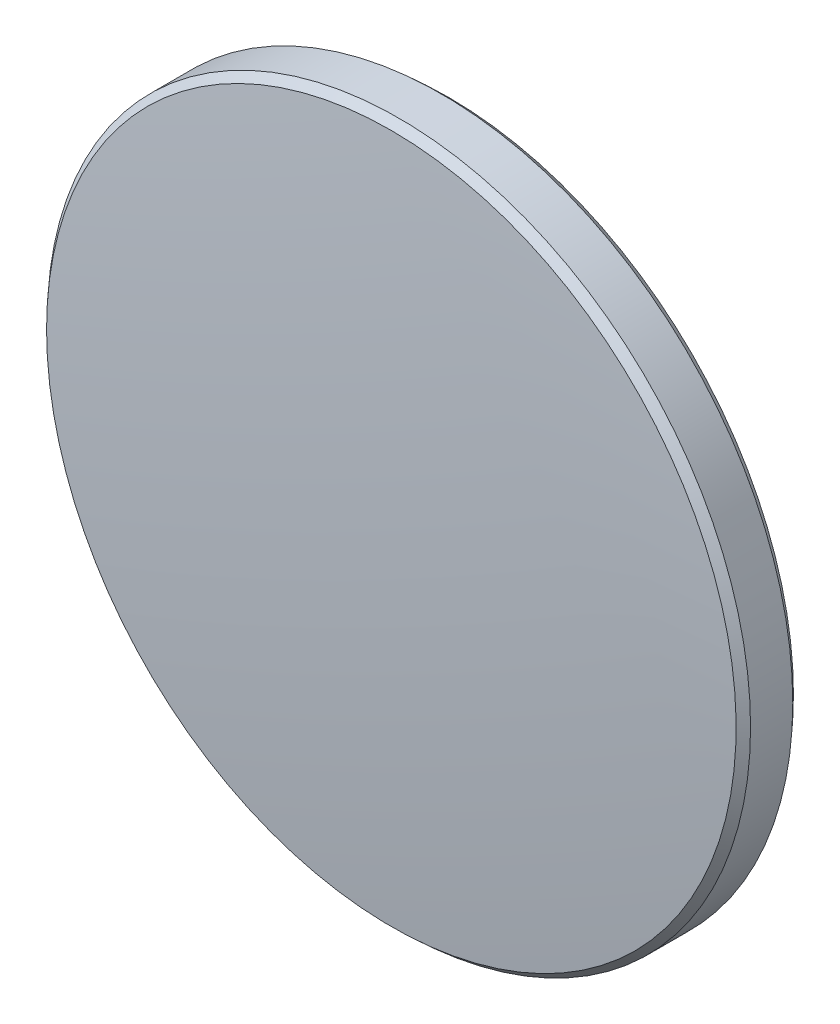
ISO-10303-21;
HEADER;
FILE_DESCRIPTION(('STEP AP214'),'2;1');
FILE_NAME('part.step','',(''),(''),'','','');
FILE_SCHEMA(('AUTOMOTIVE_DESIGN { 1 0 10303 214 1 1 1 1 }'));
ENDSEC;
DATA;
#1=APPLICATION_CONTEXT('core data for automotive mechanical design processes');
#2=APPLICATION_PROTOCOL_DEFINITION('international standard','automotive_design',2000,#1);
#3=PRODUCT_CONTEXT('',#1,'mechanical');
#4=PRODUCT('Part','Part','',(#3));
#5=PRODUCT_RELATED_PRODUCT_CATEGORY('part','',(#4));
#6=PRODUCT_DEFINITION_FORMATION('','',#4);
#7=PRODUCT_DEFINITION_CONTEXT('part definition',#1,'design');
#8=PRODUCT_DEFINITION('design','',#6,#7);
#9=PRODUCT_DEFINITION_SHAPE('','',#8);
#10=(LENGTH_UNIT() NAMED_UNIT(*) SI_UNIT(.MILLI.,.METRE.));
#11=(NAMED_UNIT(*) PLANE_ANGLE_UNIT() SI_UNIT($,.RADIAN.));
#12=(NAMED_UNIT(*) SI_UNIT($,.STERADIAN.) SOLID_ANGLE_UNIT());
#13=UNCERTAINTY_MEASURE_WITH_UNIT(LENGTH_MEASURE(1.E-05),#10,'distance_accuracy_value','');
#14=(GEOMETRIC_REPRESENTATION_CONTEXT(3) GLOBAL_UNCERTAINTY_ASSIGNED_CONTEXT((#13)) GLOBAL_UNIT_ASSIGNED_CONTEXT((#10,
#11,#12)) REPRESENTATION_CONTEXT('',''));
#15=CARTESIAN_POINT('',(0.,0.,0.));
#16=DIRECTION('',(0.,0.,1.));
#17=DIRECTION('',(1.,0.,0.));
#18=AXIS2_PLACEMENT_3D('',#15,#16,#17);
#19=CARTESIAN_POINT('',(0.,0.,-135.9));
#20=DIRECTION('',(0.,0.,1.));
#21=DIRECTION('',(0.,1.,0.));
#22=AXIS2_PLACEMENT_3D('',#19,#20,#21);
#23=SPHERICAL_SURFACE('',#22,137.5);
#24=CARTESIAN_POINT('',(0.,0.,1.03507673618941));
#25=DIRECTION('',(0.,0.,-1.));
#26=DIRECTION('',(-1.,0.,0.));
#27=AXIS2_PLACEMENT_3D('',#24,#25,#26);
#28=CIRCLE('',#27,12.4512954849652);
#29=CARTESIAN_POINT('',(-12.4512954849652,0.,1.03507673618941));
#30=VERTEX_POINT('',#29);
#31=EDGE_CURVE('E9',#30,#30,#28,.F.);
#32=ORIENTED_EDGE('',*,*,#31,.T.);
#33=EDGE_LOOP('',(#32));
#34=FACE_BOUND('',#33,.T.);
#35=ADVANCED_FACE('F13',(#34),#23,.T.);
#36=CARTESIAN_POINT('',(0.,0.,1.6));
#37=DIRECTION('',(0.,0.,1.));
#38=DIRECTION('',(1.,0.,0.));
#39=AXIS2_PLACEMENT_3D('',#36,#37,#38);
#40=CYLINDRICAL_SURFACE('',#39,12.7);
#41=CARTESIAN_POINT('',(0.,0.,-0.762234661479372));
#42=DIRECTION('',(0.,0.,1.));
#43=DIRECTION('',(1.,0.,0.));
#44=AXIS2_PLACEMENT_3D('',#41,#42,#43);
#45=CIRCLE('',#44,12.7);
#46=CARTESIAN_POINT('',(12.7,0.,-0.762234661479372));
#47=VERTEX_POINT('',#46);
#48=EDGE_CURVE('E24',#47,#47,#45,.T.);
#49=ORIENTED_EDGE('',*,*,#48,.T.);
#50=EDGE_LOOP('',(#49));
#51=FACE_BOUND('',#50,.T.);
#52=CARTESIAN_POINT('',(0.,0.,0.762234661479372));
#53=DIRECTION('',(0.,0.,-1.));
#54=DIRECTION('',(-1.,0.,0.));
#55=AXIS2_PLACEMENT_3D('',#52,#53,#54);
#56=CIRCLE('',#55,12.7);
#57=CARTESIAN_POINT('',(-12.7,0.,0.762234661479372));
#58=VERTEX_POINT('',#57);
#59=EDGE_CURVE('E28',#58,#58,#56,.T.);
#60=ORIENTED_EDGE('',*,*,#59,.T.);
#61=EDGE_LOOP('',(#60));
#62=FACE_BOUND('',#61,.T.);
#63=ADVANCED_FACE('F34',(#51,#62),#40,.T.);
#64=CARTESIAN_POINT('',(0.,0.,135.9));
#65=DIRECTION('',(0.,0.,1.));
#66=DIRECTION('',(0.,1.,0.));
#67=AXIS2_PLACEMENT_3D('',#64,#65,#66);
#68=SPHERICAL_SURFACE('',#67,137.5);
#69=CARTESIAN_POINT('',(0.,0.,-1.03507673618941));
#70=DIRECTION('',(0.,0.,1.));
#71=DIRECTION('',(1.,0.,0.));
#72=AXIS2_PLACEMENT_3D('',#69,#70,#71);
#73=CIRCLE('',#72,12.4512954849652);
#74=CARTESIAN_POINT('',(12.4512954849652,0.,-1.03507673618941));
#75=VERTEX_POINT('',#74);
#76=EDGE_CURVE('E20',#75,#75,#73,.F.);
#77=ORIENTED_EDGE('',*,*,#76,.T.);
#78=EDGE_LOOP('',(#77));
#79=FACE_BOUND('',#78,.T.);
#80=ADVANCED_FACE('F43',(#79),#68,.T.);
#81=CARTESIAN_POINT('',(0.,0.,-0.762234661479372));
#82=DIRECTION('',(0.,0.,1.));
#83=DIRECTION('',(1.,0.,0.));
#84=AXIS2_PLACEMENT_3D('',#81,#82,#83);
#85=CONICAL_SURFACE('',#84,12.7,0.739150428682718);
#86=ORIENTED_EDGE('',*,*,#76,.F.);
#87=EDGE_LOOP('',(#86));
#88=FACE_BOUND('',#87,.T.);
#89=ORIENTED_EDGE('',*,*,#48,.F.);
#90=EDGE_LOOP('',(#89));
#91=FACE_BOUND('',#90,.T.);
#92=ADVANCED_FACE('F38',(#88,#91),#85,.T.);
#93=CARTESIAN_POINT('',(0.,0.,1.03507673618941));
#94=DIRECTION('',(0.,0.,-1.));
#95=DIRECTION('',(-1.,0.,0.));
#96=AXIS2_PLACEMENT_3D('',#93,#94,#95);
#97=CONICAL_SURFACE('',#96,12.4512954849652,0.739150428682718);
#98=ORIENTED_EDGE('',*,*,#59,.F.);
#99=EDGE_LOOP('',(#98));
#100=FACE_BOUND('',#99,.T.);
#101=ORIENTED_EDGE('',*,*,#31,.F.);
#102=EDGE_LOOP('',(#101));
#103=FACE_BOUND('',#102,.T.);
#104=ADVANCED_FACE('F15',(#100,#103),#97,.T.);
#105=CLOSED_SHELL('',(#35,#63,#80,#92,#104));
#106=MANIFOLD_SOLID_BREP('B1',#105);
#107=ADVANCED_BREP_SHAPE_REPRESENTATION('',(#18,#106),#14);
#108=SHAPE_DEFINITION_REPRESENTATION(#9,#107);
ENDSEC;
END-ISO-10303-21;
